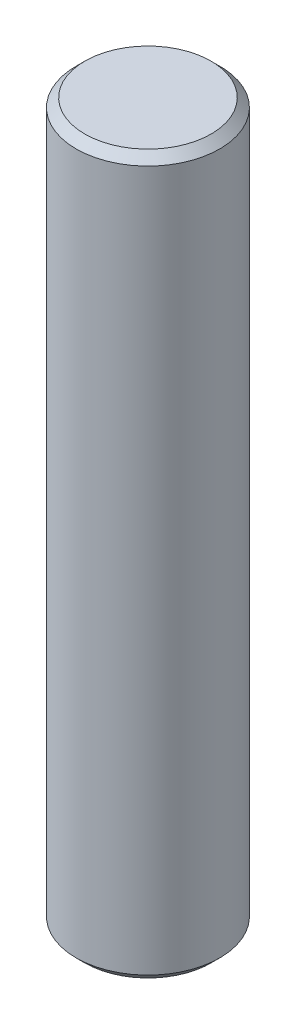
ISO-10303-21;
HEADER;
FILE_DESCRIPTION(('STEP AP214'),'2;1');
FILE_NAME('part.step','',(''),(''),'','','');
FILE_SCHEMA(('AUTOMOTIVE_DESIGN { 1 0 10303 214 1 1 1 1 }'));
ENDSEC;
DATA;
#1=APPLICATION_CONTEXT('core data for automotive mechanical design processes');
#2=APPLICATION_PROTOCOL_DEFINITION('international standard','automotive_design',2000,#1);
#3=PRODUCT_CONTEXT('',#1,'mechanical');
#4=PRODUCT('Part','Part','',(#3));
#5=PRODUCT_RELATED_PRODUCT_CATEGORY('part','',(#4));
#6=PRODUCT_DEFINITION_FORMATION('','',#4);
#7=PRODUCT_DEFINITION_CONTEXT('part definition',#1,'design');
#8=PRODUCT_DEFINITION('design','',#6,#7);
#9=PRODUCT_DEFINITION_SHAPE('','',#8);
#10=(LENGTH_UNIT() NAMED_UNIT(*) SI_UNIT(.MILLI.,.METRE.));
#11=(NAMED_UNIT(*) PLANE_ANGLE_UNIT() SI_UNIT($,.RADIAN.));
#12=(NAMED_UNIT(*) SI_UNIT($,.STERADIAN.) SOLID_ANGLE_UNIT());
#13=UNCERTAINTY_MEASURE_WITH_UNIT(LENGTH_MEASURE(1.E-05),#10,'distance_accuracy_value','');
#14=(GEOMETRIC_REPRESENTATION_CONTEXT(3) GLOBAL_UNCERTAINTY_ASSIGNED_CONTEXT((#13)) GLOBAL_UNIT_ASSIGNED_CONTEXT((#10,
#11,#12)) REPRESENTATION_CONTEXT('',''));
#15=CARTESIAN_POINT('',(0.,0.,0.));
#16=DIRECTION('',(0.,0.,1.));
#17=DIRECTION('',(1.,0.,0.));
#18=AXIS2_PLACEMENT_3D('',#15,#16,#17);
#19=CARTESIAN_POINT('',(0.,63.5,0.));
#20=DIRECTION('',(0.,-1.,0.));
#21=DIRECTION('',(0.,0.,-1.));
#22=AXIS2_PLACEMENT_3D('',#19,#20,#21);
#23=CYLINDRICAL_SURFACE('',#22,6.35);
#24=CARTESIAN_POINT('',(0.,62.738,0.));
#25=DIRECTION('',(0.,1.,0.));
#26=DIRECTION('',(0.,0.,1.));
#27=AXIS2_PLACEMENT_3D('',#24,#25,#26);
#28=CIRCLE('',#27,6.35);
#29=CARTESIAN_POINT('',(0.,62.738,6.35));
#30=VERTEX_POINT('',#29);
#31=EDGE_CURVE('E53',#30,#30,#28,.F.);
#32=ORIENTED_EDGE('',*,*,#31,.T.);
#33=EDGE_LOOP('',(#32));
#34=FACE_BOUND('',#33,.T.);
#35=CARTESIAN_POINT('',(0.,0.761999999999985,0.));
#36=DIRECTION('',(0.,1.,0.));
#37=DIRECTION('',(0.,0.,1.));
#38=AXIS2_PLACEMENT_3D('',#35,#36,#37);
#39=CIRCLE('',#38,6.35);
#40=CARTESIAN_POINT('',(0.,0.761999999999985,6.35));
#41=VERTEX_POINT('',#40);
#42=EDGE_CURVE('E60',#41,#41,#39,.T.);
#43=ORIENTED_EDGE('',*,*,#42,.T.);
#44=EDGE_LOOP('',(#43));
#45=FACE_BOUND('',#44,.T.);
#46=ADVANCED_FACE('F44',(#34,#45),#23,.T.);
#47=CARTESIAN_POINT('',(0.,63.5,0.));
#48=DIRECTION('',(0.,1.,0.));
#49=DIRECTION('',(0.,0.,1.));
#50=AXIS2_PLACEMENT_3D('',#47,#48,#49);
#51=PLANE('',#50);
#52=CARTESIAN_POINT('',(0.,63.5,0.));
#53=DIRECTION('',(0.,1.,0.));
#54=DIRECTION('',(0.,0.,1.));
#55=AXIS2_PLACEMENT_3D('',#52,#53,#54);
#56=CIRCLE('',#55,5.588);
#57=CARTESIAN_POINT('',(0.,63.5,5.58799999999999));
#58=VERTEX_POINT('',#57);
#59=EDGE_CURVE('E67',#58,#58,#56,.T.);
#60=ORIENTED_EDGE('',*,*,#59,.T.);
#61=EDGE_LOOP('',(#60));
#62=FACE_BOUND('',#61,.T.);
#63=ADVANCED_FACE('F76',(#62),#51,.T.);
#64=CARTESIAN_POINT('',(0.,0.,0.));
#65=DIRECTION('',(0.,1.,0.));
#66=DIRECTION('',(0.,0.,1.));
#67=AXIS2_PLACEMENT_3D('',#64,#65,#66);
#68=PLANE('',#67);
#69=CARTESIAN_POINT('',(0.,0.,0.));
#70=DIRECTION('',(0.,1.,0.));
#71=DIRECTION('',(0.,0.,1.));
#72=AXIS2_PLACEMENT_3D('',#69,#70,#71);
#73=CIRCLE('',#72,5.588);
#74=CARTESIAN_POINT('',(0.,0.,5.588));
#75=VERTEX_POINT('',#74);
#76=EDGE_CURVE('E10',#75,#75,#73,.F.);
#77=ORIENTED_EDGE('',*,*,#76,.T.);
#78=EDGE_LOOP('',(#77));
#79=FACE_BOUND('',#78,.T.);
#80=ADVANCED_FACE('F80',(#79),#68,.F.);
#81=CARTESIAN_POINT('',(0.,63.5,0.));
#82=DIRECTION('',(0.,-1.,0.));
#83=DIRECTION('',(0.,0.,-1.));
#84=AXIS2_PLACEMENT_3D('',#81,#82,#83);
#85=CONICAL_SURFACE('',#84,5.588,0.785398163397452);
#86=ORIENTED_EDGE('',*,*,#31,.F.);
#87=EDGE_LOOP('',(#86));
#88=FACE_BOUND('',#87,.T.);
#89=ORIENTED_EDGE('',*,*,#59,.F.);
#90=EDGE_LOOP('',(#89));
#91=FACE_BOUND('',#90,.T.);
#92=ADVANCED_FACE('F78',(#88,#91),#85,.T.);
#93=CARTESIAN_POINT('',(0.,0.761999999999985,0.));
#94=DIRECTION('',(0.,1.,0.));
#95=DIRECTION('',(0.,0.,1.));
#96=AXIS2_PLACEMENT_3D('',#93,#94,#95);
#97=CONICAL_SURFACE('',#96,6.35,0.785398163397456);
#98=ORIENTED_EDGE('',*,*,#76,.F.);
#99=EDGE_LOOP('',(#98));
#100=FACE_BOUND('',#99,.T.);
#101=ORIENTED_EDGE('',*,*,#42,.F.);
#102=EDGE_LOOP('',(#101));
#103=FACE_BOUND('',#102,.T.);
#104=ADVANCED_FACE('F47',(#100,#103),#97,.T.);
#105=CLOSED_SHELL('',(#46,#63,#80,#92,#104));
#106=MANIFOLD_SOLID_BREP('B2',#105);
#107=ADVANCED_BREP_SHAPE_REPRESENTATION('',(#18,#106),#14);
#108=SHAPE_DEFINITION_REPRESENTATION(#9,#107);
ENDSEC;
END-ISO-10303-21;
